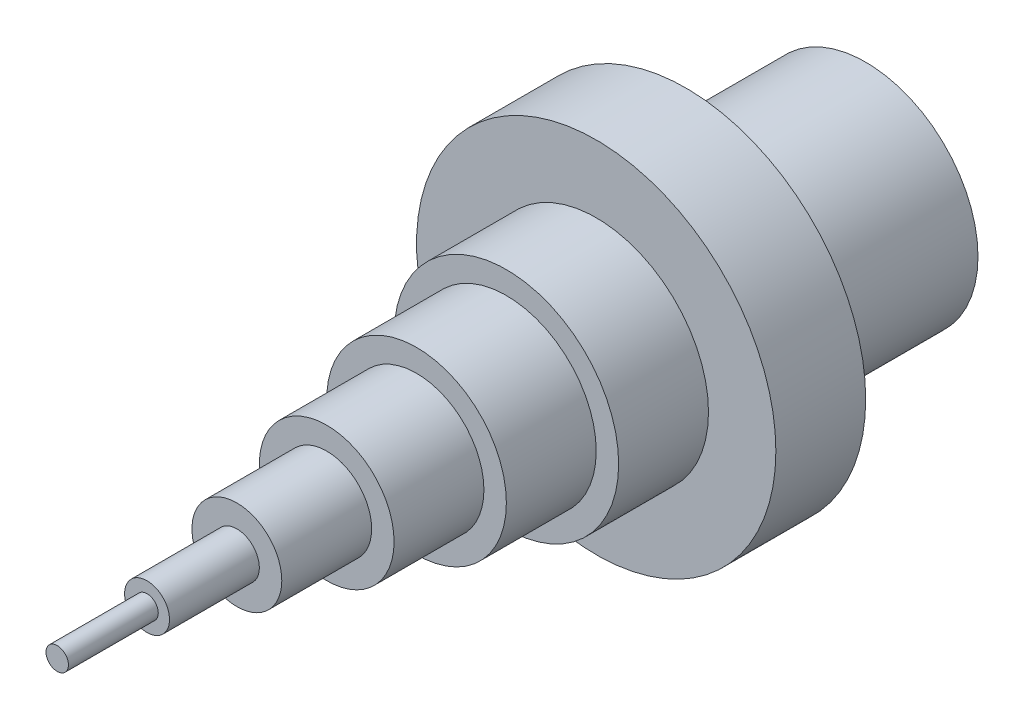
ISO-10303-21;
HEADER;
FILE_DESCRIPTION(('STEP AP214'),'2;1');
FILE_NAME('part.step','',(''),(''),'','','');
FILE_SCHEMA(('AUTOMOTIVE_DESIGN { 1 0 10303 214 1 1 1 1 }'));
ENDSEC;
DATA;
#1=APPLICATION_CONTEXT('core data for automotive mechanical design processes');
#2=APPLICATION_PROTOCOL_DEFINITION('international standard','automotive_design',2000,#1);
#3=PRODUCT_CONTEXT('',#1,'mechanical');
#4=PRODUCT('Part','Part','',(#3));
#5=PRODUCT_RELATED_PRODUCT_CATEGORY('part','',(#4));
#6=PRODUCT_DEFINITION_FORMATION('','',#4);
#7=PRODUCT_DEFINITION_CONTEXT('part definition',#1,'design');
#8=PRODUCT_DEFINITION('design','',#6,#7);
#9=PRODUCT_DEFINITION_SHAPE('','',#8);
#10=(LENGTH_UNIT() NAMED_UNIT(*) SI_UNIT(.MILLI.,.METRE.));
#11=(NAMED_UNIT(*) PLANE_ANGLE_UNIT() SI_UNIT($,.RADIAN.));
#12=(NAMED_UNIT(*) SI_UNIT($,.STERADIAN.) SOLID_ANGLE_UNIT());
#13=UNCERTAINTY_MEASURE_WITH_UNIT(LENGTH_MEASURE(1.E-05),#10,'distance_accuracy_value','');
#14=(GEOMETRIC_REPRESENTATION_CONTEXT(3) GLOBAL_UNCERTAINTY_ASSIGNED_CONTEXT((#13)) GLOBAL_UNIT_ASSIGNED_CONTEXT((#10,
#11,#12)) REPRESENTATION_CONTEXT('',''));
#15=CARTESIAN_POINT('',(0.,0.,0.));
#16=DIRECTION('',(0.,0.,1.));
#17=DIRECTION('',(1.,0.,0.));
#18=AXIS2_PLACEMENT_3D('',#15,#16,#17);
#19=CARTESIAN_POINT('',(0.,0.,0.));
#20=DIRECTION('',(0.,0.,1.));
#21=DIRECTION('',(1.,0.,0.));
#22=AXIS2_PLACEMENT_3D('',#19,#20,#21);
#23=PLANE('',#22);
#24=CARTESIAN_POINT('',(0.,0.,0.));
#25=DIRECTION('',(0.,0.,1.));
#26=DIRECTION('',(1.,0.,0.));
#27=AXIS2_PLACEMENT_3D('',#24,#25,#26);
#28=CIRCLE('',#27,2.5);
#29=CARTESIAN_POINT('',(2.5,0.,0.));
#30=VERTEX_POINT('',#29);
#31=EDGE_CURVE('E10',#30,#30,#28,.T.);
#32=ORIENTED_EDGE('',*,*,#31,.T.);
#33=EDGE_LOOP('',(#32));
#34=FACE_BOUND('',#33,.T.);
#35=ADVANCED_FACE('F31',(#34),#23,.T.);
#36=CARTESIAN_POINT('',(0.,0.,0.));
#37=DIRECTION('',(0.,0.,1.));
#38=DIRECTION('',(1.,0.,0.));
#39=AXIS2_PLACEMENT_3D('',#36,#37,#38);
#40=CYLINDRICAL_SURFACE('',#39,2.5);
#41=CARTESIAN_POINT('',(0.,0.,-20.));
#42=DIRECTION('',(0.,0.,1.));
#43=DIRECTION('',(1.,0.,0.));
#44=AXIS2_PLACEMENT_3D('',#41,#42,#43);
#45=CIRCLE('',#44,2.5);
#46=CARTESIAN_POINT('',(2.5,0.,-20.));
#47=VERTEX_POINT('',#46);
#48=EDGE_CURVE('E37',#47,#47,#45,.T.);
#49=ORIENTED_EDGE('',*,*,#48,.T.);
#50=EDGE_LOOP('',(#49));
#51=FACE_BOUND('',#50,.T.);
#52=ORIENTED_EDGE('',*,*,#31,.F.);
#53=EDGE_LOOP('',(#52));
#54=FACE_BOUND('',#53,.T.);
#55=ADVANCED_FACE('F188',(#51,#54),#40,.T.);
#56=CARTESIAN_POINT('',(2.5,0.,-20.));
#57=DIRECTION('',(0.,0.,1.));
#58=DIRECTION('',(1.,0.,0.));
#59=AXIS2_PLACEMENT_3D('',#56,#57,#58);
#60=PLANE('',#59);
#61=CARTESIAN_POINT('',(0.,0.,-20.));
#62=DIRECTION('',(0.,0.,1.));
#63=DIRECTION('',(1.,0.,0.));
#64=AXIS2_PLACEMENT_3D('',#61,#62,#63);
#65=CIRCLE('',#64,5.);
#66=CARTESIAN_POINT('',(5.,0.,-20.));
#67=VERTEX_POINT('',#66);
#68=EDGE_CURVE('E41',#67,#67,#65,.T.);
#69=ORIENTED_EDGE('',*,*,#68,.T.);
#70=EDGE_LOOP('',(#69));
#71=FACE_BOUND('',#70,.T.);
#72=ORIENTED_EDGE('',*,*,#48,.F.);
#73=EDGE_LOOP('',(#72));
#74=FACE_BOUND('',#73,.T.);
#75=ADVANCED_FACE('F182',(#71,#74),#60,.T.);
#76=CARTESIAN_POINT('',(0.,0.,0.));
#77=DIRECTION('',(0.,0.,1.));
#78=DIRECTION('',(1.,0.,0.));
#79=AXIS2_PLACEMENT_3D('',#76,#77,#78);
#80=CYLINDRICAL_SURFACE('',#79,5.);
#81=CARTESIAN_POINT('',(0.,0.,-40.));
#82=DIRECTION('',(0.,0.,1.));
#83=DIRECTION('',(1.,0.,0.));
#84=AXIS2_PLACEMENT_3D('',#81,#82,#83);
#85=CIRCLE('',#84,5.);
#86=CARTESIAN_POINT('',(5.,0.,-40.));
#87=VERTEX_POINT('',#86);
#88=EDGE_CURVE('E45',#87,#87,#85,.T.);
#89=ORIENTED_EDGE('',*,*,#88,.T.);
#90=EDGE_LOOP('',(#89));
#91=FACE_BOUND('',#90,.T.);
#92=ORIENTED_EDGE('',*,*,#68,.F.);
#93=EDGE_LOOP('',(#92));
#94=FACE_BOUND('',#93,.T.);
#95=ADVANCED_FACE('F176',(#91,#94),#80,.T.);
#96=CARTESIAN_POINT('',(5.,0.,-40.));
#97=DIRECTION('',(0.,0.,1.));
#98=DIRECTION('',(1.,0.,0.));
#99=AXIS2_PLACEMENT_3D('',#96,#97,#98);
#100=PLANE('',#99);
#101=CARTESIAN_POINT('',(0.,0.,-40.));
#102=DIRECTION('',(0.,0.,1.));
#103=DIRECTION('',(1.,0.,0.));
#104=AXIS2_PLACEMENT_3D('',#101,#102,#103);
#105=CIRCLE('',#104,10.);
#106=CARTESIAN_POINT('',(10.,0.,-40.));
#107=VERTEX_POINT('',#106);
#108=EDGE_CURVE('E50',#107,#107,#105,.T.);
#109=ORIENTED_EDGE('',*,*,#108,.T.);
#110=EDGE_LOOP('',(#109));
#111=FACE_BOUND('',#110,.T.);
#112=ORIENTED_EDGE('',*,*,#88,.F.);
#113=EDGE_LOOP('',(#112));
#114=FACE_BOUND('',#113,.T.);
#115=ADVANCED_FACE('F170',(#111,#114),#100,.T.);
#116=CARTESIAN_POINT('',(0.,0.,0.));
#117=DIRECTION('',(0.,0.,1.));
#118=DIRECTION('',(1.,0.,0.));
#119=AXIS2_PLACEMENT_3D('',#116,#117,#118);
#120=CYLINDRICAL_SURFACE('',#119,10.);
#121=CARTESIAN_POINT('',(0.,0.,-60.));
#122=DIRECTION('',(0.,0.,1.));
#123=DIRECTION('',(1.,0.,0.));
#124=AXIS2_PLACEMENT_3D('',#121,#122,#123);
#125=CIRCLE('',#124,10.);
#126=CARTESIAN_POINT('',(10.,0.,-60.));
#127=VERTEX_POINT('',#126);
#128=EDGE_CURVE('E53',#127,#127,#125,.T.);
#129=ORIENTED_EDGE('',*,*,#128,.T.);
#130=EDGE_LOOP('',(#129));
#131=FACE_BOUND('',#130,.T.);
#132=ORIENTED_EDGE('',*,*,#108,.F.);
#133=EDGE_LOOP('',(#132));
#134=FACE_BOUND('',#133,.T.);
#135=ADVANCED_FACE('F164',(#131,#134),#120,.T.);
#136=CARTESIAN_POINT('',(10.,0.,-60.));
#137=DIRECTION('',(0.,0.,1.));
#138=DIRECTION('',(1.,0.,0.));
#139=AXIS2_PLACEMENT_3D('',#136,#137,#138);
#140=PLANE('',#139);
#141=CARTESIAN_POINT('',(0.,0.,-60.));
#142=DIRECTION('',(0.,0.,1.));
#143=DIRECTION('',(1.,0.,0.));
#144=AXIS2_PLACEMENT_3D('',#141,#142,#143);
#145=CIRCLE('',#144,15.);
#146=CARTESIAN_POINT('',(15.,0.,-60.));
#147=VERTEX_POINT('',#146);
#148=EDGE_CURVE('E56',#147,#147,#145,.T.);
#149=ORIENTED_EDGE('',*,*,#148,.T.);
#150=EDGE_LOOP('',(#149));
#151=FACE_BOUND('',#150,.T.);
#152=ORIENTED_EDGE('',*,*,#128,.F.);
#153=EDGE_LOOP('',(#152));
#154=FACE_BOUND('',#153,.T.);
#155=ADVANCED_FACE('F158',(#151,#154),#140,.T.);
#156=CARTESIAN_POINT('',(0.,0.,0.));
#157=DIRECTION('',(0.,0.,1.));
#158=DIRECTION('',(1.,0.,0.));
#159=AXIS2_PLACEMENT_3D('',#156,#157,#158);
#160=CYLINDRICAL_SURFACE('',#159,15.);
#161=CARTESIAN_POINT('',(0.,0.,-80.));
#162=DIRECTION('',(0.,0.,1.));
#163=DIRECTION('',(1.,0.,0.));
#164=AXIS2_PLACEMENT_3D('',#161,#162,#163);
#165=CIRCLE('',#164,15.);
#166=CARTESIAN_POINT('',(15.,0.,-80.));
#167=VERTEX_POINT('',#166);
#168=EDGE_CURVE('E59',#167,#167,#165,.T.);
#169=ORIENTED_EDGE('',*,*,#168,.T.);
#170=EDGE_LOOP('',(#169));
#171=FACE_BOUND('',#170,.T.);
#172=ORIENTED_EDGE('',*,*,#148,.F.);
#173=EDGE_LOOP('',(#172));
#174=FACE_BOUND('',#173,.T.);
#175=ADVANCED_FACE('F152',(#171,#174),#160,.T.);
#176=CARTESIAN_POINT('',(15.,0.,-80.));
#177=DIRECTION('',(0.,0.,1.));
#178=DIRECTION('',(1.,0.,0.));
#179=AXIS2_PLACEMENT_3D('',#176,#177,#178);
#180=PLANE('',#179);
#181=CARTESIAN_POINT('',(0.,0.,-80.));
#182=DIRECTION('',(0.,0.,1.));
#183=DIRECTION('',(1.,0.,0.));
#184=AXIS2_PLACEMENT_3D('',#181,#182,#183);
#185=CIRCLE('',#184,20.);
#186=CARTESIAN_POINT('',(20.,0.,-80.));
#187=VERTEX_POINT('',#186);
#188=EDGE_CURVE('E62',#187,#187,#185,.T.);
#189=ORIENTED_EDGE('',*,*,#188,.T.);
#190=EDGE_LOOP('',(#189));
#191=FACE_BOUND('',#190,.T.);
#192=ORIENTED_EDGE('',*,*,#168,.F.);
#193=EDGE_LOOP('',(#192));
#194=FACE_BOUND('',#193,.T.);
#195=ADVANCED_FACE('F146',(#191,#194),#180,.T.);
#196=CARTESIAN_POINT('',(0.,0.,0.));
#197=DIRECTION('',(0.,0.,1.));
#198=DIRECTION('',(1.,0.,0.));
#199=AXIS2_PLACEMENT_3D('',#196,#197,#198);
#200=CYLINDRICAL_SURFACE('',#199,20.);
#201=CARTESIAN_POINT('',(0.,0.,-100.));
#202=DIRECTION('',(0.,0.,1.));
#203=DIRECTION('',(1.,0.,0.));
#204=AXIS2_PLACEMENT_3D('',#201,#202,#203);
#205=CIRCLE('',#204,20.);
#206=CARTESIAN_POINT('',(20.,0.,-100.));
#207=VERTEX_POINT('',#206);
#208=EDGE_CURVE('E65',#207,#207,#205,.T.);
#209=ORIENTED_EDGE('',*,*,#208,.T.);
#210=EDGE_LOOP('',(#209));
#211=FACE_BOUND('',#210,.T.);
#212=ORIENTED_EDGE('',*,*,#188,.F.);
#213=EDGE_LOOP('',(#212));
#214=FACE_BOUND('',#213,.T.);
#215=ADVANCED_FACE('F140',(#211,#214),#200,.T.);
#216=CARTESIAN_POINT('',(20.,0.,-100.));
#217=DIRECTION('',(0.,0.,1.));
#218=DIRECTION('',(1.,0.,0.));
#219=AXIS2_PLACEMENT_3D('',#216,#217,#218);
#220=PLANE('',#219);
#221=CARTESIAN_POINT('',(0.,0.,-100.));
#222=DIRECTION('',(0.,0.,1.));
#223=DIRECTION('',(1.,0.,0.));
#224=AXIS2_PLACEMENT_3D('',#221,#222,#223);
#225=CIRCLE('',#224,25.);
#226=CARTESIAN_POINT('',(25.,0.,-100.));
#227=VERTEX_POINT('',#226);
#228=EDGE_CURVE('E68',#227,#227,#225,.T.);
#229=ORIENTED_EDGE('',*,*,#228,.T.);
#230=EDGE_LOOP('',(#229));
#231=FACE_BOUND('',#230,.T.);
#232=ORIENTED_EDGE('',*,*,#208,.F.);
#233=EDGE_LOOP('',(#232));
#234=FACE_BOUND('',#233,.T.);
#235=ADVANCED_FACE('F134',(#231,#234),#220,.T.);
#236=CARTESIAN_POINT('',(0.,0.,0.));
#237=DIRECTION('',(0.,0.,1.));
#238=DIRECTION('',(1.,0.,0.));
#239=AXIS2_PLACEMENT_3D('',#236,#237,#238);
#240=CYLINDRICAL_SURFACE('',#239,25.);
#241=CARTESIAN_POINT('',(0.,0.,-120.));
#242=DIRECTION('',(0.,0.,1.));
#243=DIRECTION('',(1.,0.,0.));
#244=AXIS2_PLACEMENT_3D('',#241,#242,#243);
#245=CIRCLE('',#244,25.);
#246=CARTESIAN_POINT('',(25.,0.,-120.));
#247=VERTEX_POINT('',#246);
#248=EDGE_CURVE('E71',#247,#247,#245,.T.);
#249=ORIENTED_EDGE('',*,*,#248,.T.);
#250=EDGE_LOOP('',(#249));
#251=FACE_BOUND('',#250,.T.);
#252=ORIENTED_EDGE('',*,*,#228,.F.);
#253=EDGE_LOOP('',(#252));
#254=FACE_BOUND('',#253,.T.);
#255=ADVANCED_FACE('F128',(#251,#254),#240,.T.);
#256=CARTESIAN_POINT('',(25.,0.,-120.));
#257=DIRECTION('',(0.,0.,1.));
#258=DIRECTION('',(1.,0.,0.));
#259=AXIS2_PLACEMENT_3D('',#256,#257,#258);
#260=PLANE('',#259);
#261=CARTESIAN_POINT('',(0.,0.,-120.));
#262=DIRECTION('',(0.,0.,1.));
#263=DIRECTION('',(1.,0.,0.));
#264=AXIS2_PLACEMENT_3D('',#261,#262,#263);
#265=CIRCLE('',#264,40.);
#266=CARTESIAN_POINT('',(40.,0.,-120.));
#267=VERTEX_POINT('',#266);
#268=EDGE_CURVE('E74',#267,#267,#265,.T.);
#269=ORIENTED_EDGE('',*,*,#268,.T.);
#270=EDGE_LOOP('',(#269));
#271=FACE_BOUND('',#270,.T.);
#272=ORIENTED_EDGE('',*,*,#248,.F.);
#273=EDGE_LOOP('',(#272));
#274=FACE_BOUND('',#273,.T.);
#275=ADVANCED_FACE('F122',(#271,#274),#260,.T.);
#276=CARTESIAN_POINT('',(0.,0.,0.));
#277=DIRECTION('',(0.,0.,1.));
#278=DIRECTION('',(1.,0.,0.));
#279=AXIS2_PLACEMENT_3D('',#276,#277,#278);
#280=CYLINDRICAL_SURFACE('',#279,40.);
#281=CARTESIAN_POINT('',(0.,0.,-140.));
#282=DIRECTION('',(0.,0.,1.));
#283=DIRECTION('',(1.,0.,0.));
#284=AXIS2_PLACEMENT_3D('',#281,#282,#283);
#285=CIRCLE('',#284,40.);
#286=CARTESIAN_POINT('',(40.,0.,-140.));
#287=VERTEX_POINT('',#286);
#288=EDGE_CURVE('E77',#287,#287,#285,.T.);
#289=ORIENTED_EDGE('',*,*,#288,.T.);
#290=EDGE_LOOP('',(#289));
#291=FACE_BOUND('',#290,.T.);
#292=ORIENTED_EDGE('',*,*,#268,.F.);
#293=EDGE_LOOP('',(#292));
#294=FACE_BOUND('',#293,.T.);
#295=ADVANCED_FACE('F116',(#291,#294),#280,.T.);
#296=CARTESIAN_POINT('',(40.,0.,-140.));
#297=DIRECTION('',(0.,0.,-1.));
#298=DIRECTION('',(-1.,0.,0.));
#299=AXIS2_PLACEMENT_3D('',#296,#297,#298);
#300=PLANE('',#299);
#301=CARTESIAN_POINT('',(0.,0.,-140.));
#302=DIRECTION('',(0.,0.,1.));
#303=DIRECTION('',(1.,0.,0.));
#304=AXIS2_PLACEMENT_3D('',#301,#302,#303);
#305=CIRCLE('',#304,25.);
#306=CARTESIAN_POINT('',(25.,0.,-140.));
#307=VERTEX_POINT('',#306);
#308=EDGE_CURVE('E80',#307,#307,#305,.T.);
#309=ORIENTED_EDGE('',*,*,#308,.T.);
#310=EDGE_LOOP('',(#309));
#311=FACE_BOUND('',#310,.T.);
#312=ORIENTED_EDGE('',*,*,#288,.F.);
#313=EDGE_LOOP('',(#312));
#314=FACE_BOUND('',#313,.T.);
#315=ADVANCED_FACE('F110',(#311,#314),#300,.T.);
#316=CARTESIAN_POINT('',(0.,0.,0.));
#317=DIRECTION('',(0.,0.,1.));
#318=DIRECTION('',(1.,0.,0.));
#319=AXIS2_PLACEMENT_3D('',#316,#317,#318);
#320=CYLINDRICAL_SURFACE('',#319,25.);
#321=CARTESIAN_POINT('',(0.,0.,-180.));
#322=DIRECTION('',(0.,0.,1.));
#323=DIRECTION('',(1.,0.,0.));
#324=AXIS2_PLACEMENT_3D('',#321,#322,#323);
#325=CIRCLE('',#324,25.);
#326=CARTESIAN_POINT('',(25.,0.,-180.));
#327=VERTEX_POINT('',#326);
#328=EDGE_CURVE('E83',#327,#327,#325,.T.);
#329=ORIENTED_EDGE('',*,*,#328,.T.);
#330=EDGE_LOOP('',(#329));
#331=FACE_BOUND('',#330,.T.);
#332=ORIENTED_EDGE('',*,*,#308,.F.);
#333=EDGE_LOOP('',(#332));
#334=FACE_BOUND('',#333,.T.);
#335=ADVANCED_FACE('F104',(#331,#334),#320,.T.);
#336=CARTESIAN_POINT('',(25.,0.,-180.));
#337=DIRECTION('',(0.,0.,-1.));
#338=DIRECTION('',(-1.,0.,0.));
#339=AXIS2_PLACEMENT_3D('',#336,#337,#338);
#340=PLANE('',#339);
#341=CARTESIAN_POINT('',(0.,0.,-180.));
#342=DIRECTION('',(0.,0.,-1.));
#343=DIRECTION('',(-1.,0.,0.));
#344=AXIS2_PLACEMENT_3D('',#341,#342,#343);
#345=CIRCLE('',#344,20.);
#346=CARTESIAN_POINT('',(-20.,0.,-180.));
#347=VERTEX_POINT('',#346);
#348=EDGE_CURVE('E87',#347,#347,#345,.T.);
#349=ORIENTED_EDGE('',*,*,#348,.F.);
#350=EDGE_LOOP('',(#349));
#351=FACE_BOUND('',#350,.T.);
#352=ORIENTED_EDGE('',*,*,#328,.F.);
#353=EDGE_LOOP('',(#352));
#354=FACE_BOUND('',#353,.T.);
#355=ADVANCED_FACE('F98',(#351,#354),#340,.T.);
#356=CARTESIAN_POINT('',(0.,0.,-140.));
#357=DIRECTION('',(0.,0.,-1.));
#358=DIRECTION('',(-1.,0.,0.));
#359=AXIS2_PLACEMENT_3D('',#356,#357,#358);
#360=CYLINDRICAL_SURFACE('',#359,20.);
#361=CARTESIAN_POINT('',(0.,0.,-140.));
#362=DIRECTION('',(0.,0.,-1.));
#363=DIRECTION('',(-1.,0.,0.));
#364=AXIS2_PLACEMENT_3D('',#361,#362,#363);
#365=CIRCLE('',#364,20.);
#366=CARTESIAN_POINT('',(-20.,0.,-140.));
#367=VERTEX_POINT('',#366);
#368=EDGE_CURVE('E86',#367,#367,#365,.T.);
#369=ORIENTED_EDGE('',*,*,#368,.F.);
#370=EDGE_LOOP('',(#369));
#371=FACE_BOUND('',#370,.T.);
#372=ORIENTED_EDGE('',*,*,#348,.T.);
#373=EDGE_LOOP('',(#372));
#374=FACE_BOUND('',#373,.T.);
#375=ADVANCED_FACE('F95',(#371,#374),#360,.F.);
#376=CARTESIAN_POINT('',(0.,0.,-140.));
#377=DIRECTION('',(0.,0.,-1.));
#378=DIRECTION('',(-1.,0.,0.));
#379=AXIS2_PLACEMENT_3D('',#376,#377,#378);
#380=PLANE('',#379);
#381=ORIENTED_EDGE('',*,*,#368,.T.);
#382=EDGE_LOOP('',(#381));
#383=FACE_BOUND('',#382,.T.);
#384=ADVANCED_FACE('F93',(#383),#380,.T.);
#385=CLOSED_SHELL('',(#35,#55,#75,#95,#115,#135,#155,#175,#195,#215,#235,#255,#275,#295,#315,
#335,#355,#375,#384));
#386=MANIFOLD_SOLID_BREP('B2',#385);
#387=ADVANCED_BREP_SHAPE_REPRESENTATION('',(#18,#386),#14);
#388=SHAPE_DEFINITION_REPRESENTATION(#9,#387);
ENDSEC;
END-ISO-10303-21;
